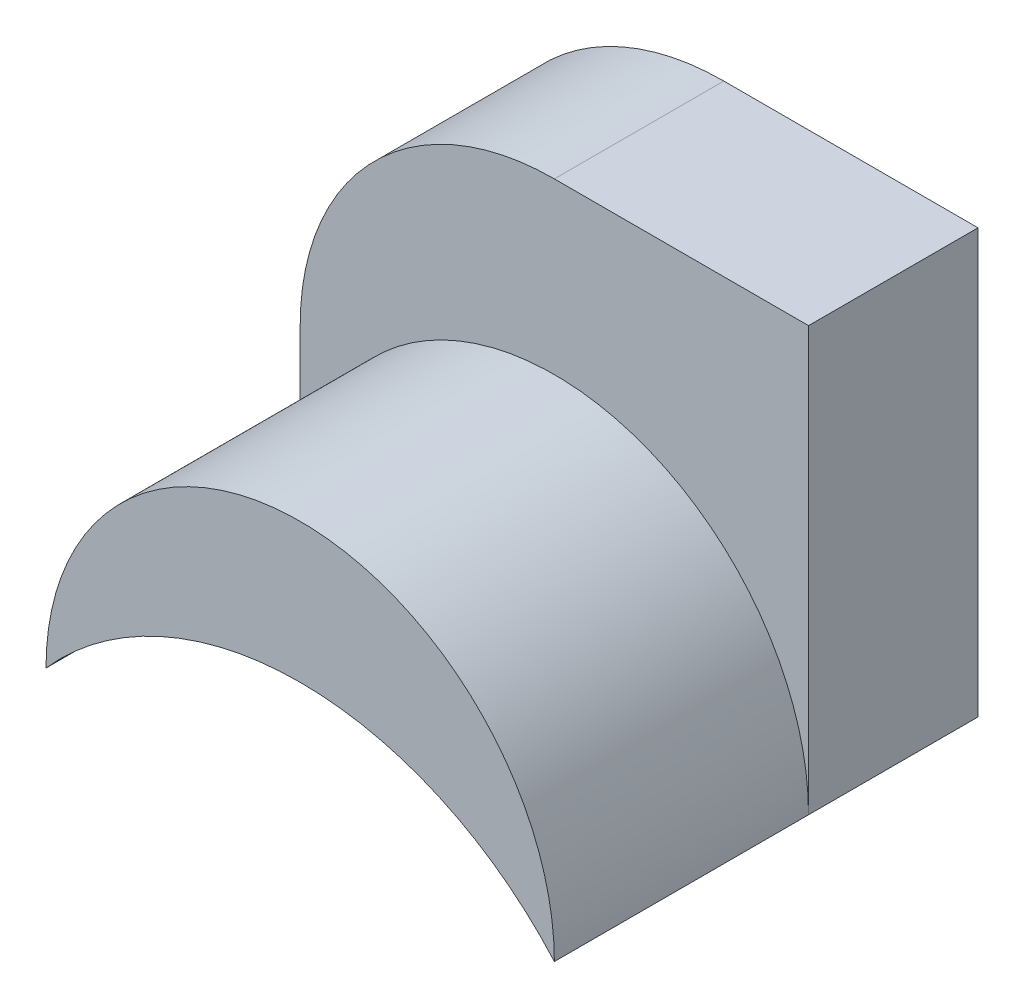
ISO-10303-21;
HEADER;
FILE_DESCRIPTION(('STEP AP214'),'2;1');
FILE_NAME('part.step','',(''),(''),'','','');
FILE_SCHEMA(('AUTOMOTIVE_DESIGN { 1 0 10303 214 1 1 1 1 }'));
ENDSEC;
DATA;
#1=APPLICATION_CONTEXT('core data for automotive mechanical design processes');
#2=APPLICATION_PROTOCOL_DEFINITION('international standard','automotive_design',2000,#1);
#3=PRODUCT_CONTEXT('',#1,'mechanical');
#4=PRODUCT('Part','Part','',(#3));
#5=PRODUCT_RELATED_PRODUCT_CATEGORY('part','',(#4));
#6=PRODUCT_DEFINITION_FORMATION('','',#4);
#7=PRODUCT_DEFINITION_CONTEXT('part definition',#1,'design');
#8=PRODUCT_DEFINITION('design','',#6,#7);
#9=PRODUCT_DEFINITION_SHAPE('','',#8);
#10=(LENGTH_UNIT() NAMED_UNIT(*) SI_UNIT(.MILLI.,.METRE.));
#11=(NAMED_UNIT(*) PLANE_ANGLE_UNIT() SI_UNIT($,.RADIAN.));
#12=(NAMED_UNIT(*) SI_UNIT($,.STERADIAN.) SOLID_ANGLE_UNIT());
#13=UNCERTAINTY_MEASURE_WITH_UNIT(LENGTH_MEASURE(1.E-05),#10,'distance_accuracy_value','');
#14=(GEOMETRIC_REPRESENTATION_CONTEXT(3) GLOBAL_UNCERTAINTY_ASSIGNED_CONTEXT((#13)) GLOBAL_UNIT_ASSIGNED_CONTEXT((#10,
#11,#12)) REPRESENTATION_CONTEXT('',''));
#15=CARTESIAN_POINT('',(0.,0.,0.));
#16=DIRECTION('',(0.,0.,1.));
#17=DIRECTION('',(1.,0.,0.));
#18=AXIS2_PLACEMENT_3D('',#15,#16,#17);
#19=CARTESIAN_POINT('',(-15.,10.,10.));
#20=DIRECTION('',(0.,0.,-1.));
#21=DIRECTION('',(-1.,0.,0.));
#22=AXIS2_PLACEMENT_3D('',#19,#20,#21);
#23=PLANE('',#22);
#24=CARTESIAN_POINT('',(-15.,-13.2287565553229,10.));
#25=DIRECTION('',(0.,0.,-1.));
#26=DIRECTION('',(-1.,0.,0.));
#27=AXIS2_PLACEMENT_3D('',#24,#25,#26);
#28=CIRCLE('',#27,20.);
#29=CARTESIAN_POINT('',(-30.,0.,10.));
#30=VERTEX_POINT('',#29);
#31=CARTESIAN_POINT('',(0.,0.,10.));
#32=VERTEX_POINT('',#31);
#33=EDGE_CURVE('E116',#30,#32,#28,.T.);
#34=ORIENTED_EDGE('',*,*,#33,.F.);
#35=DIRECTION('',(1.,0.,0.));
#36=VECTOR('',#35,1.);
#37=CARTESIAN_POINT('',(0.,0.,10.));
#38=LINE('',#37,#36);
#39=EDGE_CURVE('E128',#30,#32,#38,.T.);
#40=ORIENTED_EDGE('',*,*,#39,.T.);
#41=EDGE_LOOP('',(#34,#40));
#42=FACE_BOUND('',#41,.T.);
#43=ADVANCED_FACE('F33',(#42),#23,.F.);
#44=CARTESIAN_POINT('',(-15.,0.,10.));
#45=DIRECTION('',(0.,0.,1.));
#46=DIRECTION('',(-1.,0.,0.));
#47=AXIS2_PLACEMENT_3D('',#44,#45,#46);
#48=CIRCLE('',#47,15.);
#49=EDGE_CURVE('E112',#32,#30,#48,.T.);
#50=ORIENTED_EDGE('',*,*,#49,.F.);
#51=DIRECTION('',(0.,1.,0.));
#52=VECTOR('',#51,1.);
#53=CARTESIAN_POINT('',(0.,25.,10.));
#54=LINE('',#53,#52);
#55=CARTESIAN_POINT('',(0.,25.,10.));
#56=VERTEX_POINT('',#55);
#57=EDGE_CURVE('E131',#32,#56,#54,.T.);
#58=ORIENTED_EDGE('',*,*,#57,.T.);
#59=DIRECTION('',(-1.,0.,0.));
#60=VECTOR('',#59,1.);
#61=CARTESIAN_POINT('',(-15.,25.,10.));
#62=LINE('',#61,#60);
#63=CARTESIAN_POINT('',(-15.,25.,10.));
#64=VERTEX_POINT('',#63);
#65=EDGE_CURVE('E50',#56,#64,#62,.T.);
#66=ORIENTED_EDGE('',*,*,#65,.T.);
#67=CARTESIAN_POINT('',(-15.,10.,10.));
#68=DIRECTION('',(0.,0.,1.));
#69=DIRECTION('',(-1.,0.,0.));
#70=AXIS2_PLACEMENT_3D('',#67,#68,#69);
#71=CIRCLE('',#70,15.);
#72=CARTESIAN_POINT('',(-30.,10.,10.));
#73=VERTEX_POINT('',#72);
#74=EDGE_CURVE('E125',#64,#73,#71,.T.);
#75=ORIENTED_EDGE('',*,*,#74,.T.);
#76=DIRECTION('',(0.,-1.,0.));
#77=VECTOR('',#76,1.);
#78=CARTESIAN_POINT('',(-30.,0.,10.));
#79=LINE('',#78,#77);
#80=EDGE_CURVE('E84',#73,#30,#79,.T.);
#81=ORIENTED_EDGE('',*,*,#80,.T.);
#82=EDGE_LOOP('',(#50,#58,#66,#75,#81));
#83=FACE_BOUND('',#82,.T.);
#84=ADVANCED_FACE('F158',(#83),#23,.F.);
#85=CARTESIAN_POINT('',(-15.,10.,10.));
#86=DIRECTION('',(0.,0.,-1.));
#87=DIRECTION('',(-1.,0.,0.));
#88=AXIS2_PLACEMENT_3D('',#85,#86,#87);
#89=CYLINDRICAL_SURFACE('',#88,15.);
#90=CARTESIAN_POINT('',(-15.,10.,0.));
#91=DIRECTION('',(0.,0.,1.));
#92=DIRECTION('',(-1.,0.,0.));
#93=AXIS2_PLACEMENT_3D('',#90,#91,#92);
#94=CIRCLE('',#93,15.);
#95=CARTESIAN_POINT('',(-15.,25.,0.));
#96=VERTEX_POINT('',#95);
#97=CARTESIAN_POINT('',(-30.,10.,0.));
#98=VERTEX_POINT('',#97);
#99=EDGE_CURVE('E117',#96,#98,#94,.T.);
#100=ORIENTED_EDGE('',*,*,#99,.T.);
#101=DIRECTION('',(0.,0.,-1.));
#102=VECTOR('',#101,1.);
#103=CARTESIAN_POINT('',(-30.,10.,10.));
#104=LINE('',#103,#102);
#105=EDGE_CURVE('E11',#73,#98,#104,.T.);
#106=ORIENTED_EDGE('',*,*,#105,.F.);
#107=ORIENTED_EDGE('',*,*,#74,.F.);
#108=DIRECTION('',(0.,0.,-1.));
#109=VECTOR('',#108,1.);
#110=CARTESIAN_POINT('',(-15.,25.,10.));
#111=LINE('',#110,#109);
#112=EDGE_CURVE('E133',#64,#96,#111,.T.);
#113=ORIENTED_EDGE('',*,*,#112,.T.);
#114=EDGE_LOOP('',(#100,#106,#107,#113));
#115=FACE_BOUND('',#114,.T.);
#116=ADVANCED_FACE('F35',(#115),#89,.T.);
#117=CARTESIAN_POINT('',(-30.,0.,10.));
#118=DIRECTION('',(1.,0.,0.));
#119=DIRECTION('',(0.,0.,-1.));
#120=AXIS2_PLACEMENT_3D('',#117,#118,#119);
#121=PLANE('',#120);
#122=DIRECTION('',(0.,-1.,0.));
#123=VECTOR('',#122,1.);
#124=CARTESIAN_POINT('',(-30.,0.,0.));
#125=LINE('',#124,#123);
#126=CARTESIAN_POINT('',(-30.,0.,0.));
#127=VERTEX_POINT('',#126);
#128=EDGE_CURVE('E120',#98,#127,#125,.T.);
#129=ORIENTED_EDGE('',*,*,#128,.T.);
#130=DIRECTION('',(0.,0.,-1.));
#131=VECTOR('',#130,1.);
#132=CARTESIAN_POINT('',(-30.,0.,10.));
#133=LINE('',#132,#131);
#134=EDGE_CURVE('E42',#30,#127,#133,.T.);
#135=ORIENTED_EDGE('',*,*,#134,.F.);
#136=ORIENTED_EDGE('',*,*,#80,.F.);
#137=ORIENTED_EDGE('',*,*,#105,.T.);
#138=EDGE_LOOP('',(#129,#135,#136,#137));
#139=FACE_BOUND('',#138,.T.);
#140=ADVANCED_FACE('F176',(#139),#121,.F.);
#141=CARTESIAN_POINT('',(0.,0.,10.));
#142=DIRECTION('',(0.,1.,0.));
#143=DIRECTION('',(-1.,0.,0.));
#144=AXIS2_PLACEMENT_3D('',#141,#142,#143);
#145=PLANE('',#144);
#146=DIRECTION('',(1.,0.,0.));
#147=VECTOR('',#146,1.);
#148=CARTESIAN_POINT('',(0.,0.,0.));
#149=LINE('',#148,#147);
#150=CARTESIAN_POINT('',(0.,0.,0.));
#151=VERTEX_POINT('',#150);
#152=EDGE_CURVE('E136',#127,#151,#149,.T.);
#153=ORIENTED_EDGE('',*,*,#152,.T.);
#154=DIRECTION('',(0.,0.,-1.));
#155=VECTOR('',#154,1.);
#156=CARTESIAN_POINT('',(0.,0.,10.));
#157=LINE('',#156,#155);
#158=EDGE_CURVE('E143',#32,#151,#157,.T.);
#159=ORIENTED_EDGE('',*,*,#158,.F.);
#160=ORIENTED_EDGE('',*,*,#39,.F.);
#161=ORIENTED_EDGE('',*,*,#134,.T.);
#162=EDGE_LOOP('',(#153,#159,#160,#161));
#163=FACE_BOUND('',#162,.T.);
#164=ADVANCED_FACE('F147',(#163),#145,.F.);
#165=CARTESIAN_POINT('',(0.,25.,10.));
#166=DIRECTION('',(-1.,0.,0.));
#167=DIRECTION('',(0.,0.,1.));
#168=AXIS2_PLACEMENT_3D('',#165,#166,#167);
#169=PLANE('',#168);
#170=DIRECTION('',(0.,1.,0.));
#171=VECTOR('',#170,1.);
#172=CARTESIAN_POINT('',(0.,25.,0.));
#173=LINE('',#172,#171);
#174=CARTESIAN_POINT('',(0.,25.,0.));
#175=VERTEX_POINT('',#174);
#176=EDGE_CURVE('E71',#151,#175,#173,.T.);
#177=ORIENTED_EDGE('',*,*,#176,.T.);
#178=DIRECTION('',(0.,0.,-1.));
#179=VECTOR('',#178,1.);
#180=CARTESIAN_POINT('',(0.,25.,10.));
#181=LINE('',#180,#179);
#182=EDGE_CURVE('E141',#56,#175,#181,.T.);
#183=ORIENTED_EDGE('',*,*,#182,.F.);
#184=ORIENTED_EDGE('',*,*,#57,.F.);
#185=ORIENTED_EDGE('',*,*,#158,.T.);
#186=EDGE_LOOP('',(#177,#183,#184,#185));
#187=FACE_BOUND('',#186,.T.);
#188=ADVANCED_FACE('F157',(#187),#169,.F.);
#189=CARTESIAN_POINT('',(-15.,25.,10.));
#190=DIRECTION('',(0.,-1.,0.));
#191=DIRECTION('',(1.,0.,0.));
#192=AXIS2_PLACEMENT_3D('',#189,#190,#191);
#193=PLANE('',#192);
#194=DIRECTION('',(-1.,0.,0.));
#195=VECTOR('',#194,1.);
#196=CARTESIAN_POINT('',(-15.,25.,0.));
#197=LINE('',#196,#195);
#198=EDGE_CURVE('E77',#175,#96,#197,.T.);
#199=ORIENTED_EDGE('',*,*,#198,.T.);
#200=ORIENTED_EDGE('',*,*,#112,.F.);
#201=ORIENTED_EDGE('',*,*,#65,.F.);
#202=ORIENTED_EDGE('',*,*,#182,.T.);
#203=EDGE_LOOP('',(#199,#200,#201,#202));
#204=FACE_BOUND('',#203,.T.);
#205=ADVANCED_FACE('F155',(#204),#193,.F.);
#206=CARTESIAN_POINT('',(-15.,10.,0.));
#207=DIRECTION('',(0.,0.,-1.));
#208=DIRECTION('',(-1.,0.,0.));
#209=AXIS2_PLACEMENT_3D('',#206,#207,#208);
#210=PLANE('',#209);
#211=ORIENTED_EDGE('',*,*,#99,.F.);
#212=ORIENTED_EDGE('',*,*,#198,.F.);
#213=ORIENTED_EDGE('',*,*,#176,.F.);
#214=ORIENTED_EDGE('',*,*,#152,.F.);
#215=ORIENTED_EDGE('',*,*,#128,.F.);
#216=EDGE_LOOP('',(#211,#212,#213,#214,#215));
#217=FACE_BOUND('',#216,.T.);
#218=ADVANCED_FACE('F151',(#217),#210,.T.);
#219=CARTESIAN_POINT('',(-15.,-13.2287565553229,25.));
#220=DIRECTION('',(0.,0.,-1.));
#221=DIRECTION('',(-1.,0.,0.));
#222=AXIS2_PLACEMENT_3D('',#219,#220,#221);
#223=CYLINDRICAL_SURFACE('',#222,20.);
#224=ORIENTED_EDGE('',*,*,#33,.T.);
#225=DIRECTION('',(0.,0.,-1.));
#226=VECTOR('',#225,1.);
#227=CARTESIAN_POINT('',(0.,0.,25.));
#228=LINE('',#227,#226);
#229=CARTESIAN_POINT('',(0.,0.,25.));
#230=VERTEX_POINT('',#229);
#231=EDGE_CURVE('E102',#230,#32,#228,.T.);
#232=ORIENTED_EDGE('',*,*,#231,.F.);
#233=CARTESIAN_POINT('',(-15.,-13.2287565553229,25.));
#234=DIRECTION('',(0.,0.,-1.));
#235=DIRECTION('',(-1.,0.,0.));
#236=AXIS2_PLACEMENT_3D('',#233,#234,#235);
#237=CIRCLE('',#236,20.);
#238=CARTESIAN_POINT('',(-30.,0.,25.));
#239=VERTEX_POINT('',#238);
#240=EDGE_CURVE('E108',#239,#230,#237,.T.);
#241=ORIENTED_EDGE('',*,*,#240,.F.);
#242=DIRECTION('',(0.,0.,-1.));
#243=VECTOR('',#242,1.);
#244=CARTESIAN_POINT('',(-30.,0.,25.));
#245=LINE('',#244,#243);
#246=EDGE_CURVE('E105',#239,#30,#245,.T.);
#247=ORIENTED_EDGE('',*,*,#246,.T.);
#248=EDGE_LOOP('',(#224,#232,#241,#247));
#249=FACE_BOUND('',#248,.T.);
#250=ADVANCED_FACE('F114',(#249),#223,.F.);
#251=CARTESIAN_POINT('',(-15.,0.,25.));
#252=DIRECTION('',(0.,0.,-1.));
#253=DIRECTION('',(-1.,0.,0.));
#254=AXIS2_PLACEMENT_3D('',#251,#252,#253);
#255=CYLINDRICAL_SURFACE('',#254,15.);
#256=ORIENTED_EDGE('',*,*,#49,.T.);
#257=ORIENTED_EDGE('',*,*,#246,.F.);
#258=CARTESIAN_POINT('',(-15.,0.,25.));
#259=DIRECTION('',(0.,0.,1.));
#260=DIRECTION('',(-1.,0.,0.));
#261=AXIS2_PLACEMENT_3D('',#258,#259,#260);
#262=CIRCLE('',#261,15.);
#263=EDGE_CURVE('E97',#230,#239,#262,.T.);
#264=ORIENTED_EDGE('',*,*,#263,.F.);
#265=ORIENTED_EDGE('',*,*,#231,.T.);
#266=EDGE_LOOP('',(#256,#257,#264,#265));
#267=FACE_BOUND('',#266,.T.);
#268=ADVANCED_FACE('F100',(#267),#255,.T.);
#269=CARTESIAN_POINT('',(-15.,-6.61437827766147,25.));
#270=DIRECTION('',(0.,0.,-1.));
#271=DIRECTION('',(-1.,0.,0.));
#272=AXIS2_PLACEMENT_3D('',#269,#270,#271);
#273=PLANE('',#272);
#274=ORIENTED_EDGE('',*,*,#240,.T.);
#275=ORIENTED_EDGE('',*,*,#263,.T.);
#276=EDGE_LOOP('',(#274,#275));
#277=FACE_BOUND('',#276,.T.);
#278=ADVANCED_FACE('F110',(#277),#273,.F.);
#279=CLOSED_SHELL('',(#43,#84,#116,#140,#164,#188,#205,#218,#250,#268,#278));
#280=MANIFOLD_SOLID_BREP('B2',#279);
#281=ADVANCED_BREP_SHAPE_REPRESENTATION('',(#18,#280),#14);
#282=SHAPE_DEFINITION_REPRESENTATION(#9,#281);
ENDSEC;
END-ISO-10303-21;
